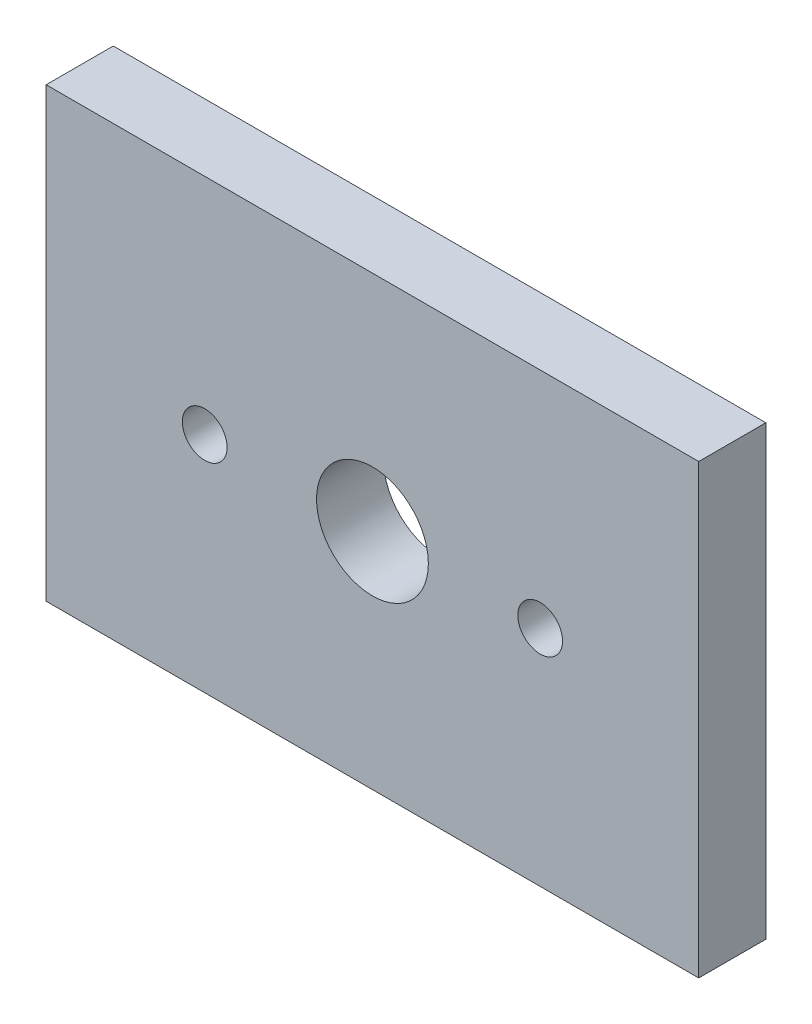
ISO-10303-21;
HEADER;
FILE_DESCRIPTION(('STEP AP214'),'2;1');
FILE_NAME('part.step','',(''),(''),'','','');
FILE_SCHEMA(('AUTOMOTIVE_DESIGN { 1 0 10303 214 1 1 1 1 }'));
ENDSEC;
DATA;
#1=APPLICATION_CONTEXT('core data for automotive mechanical design processes');
#2=APPLICATION_PROTOCOL_DEFINITION('international standard','automotive_design',2000,#1);
#3=PRODUCT_CONTEXT('',#1,'mechanical');
#4=PRODUCT('Part','Part','',(#3));
#5=PRODUCT_RELATED_PRODUCT_CATEGORY('part','',(#4));
#6=PRODUCT_DEFINITION_FORMATION('','',#4);
#7=PRODUCT_DEFINITION_CONTEXT('part definition',#1,'design');
#8=PRODUCT_DEFINITION('design','',#6,#7);
#9=PRODUCT_DEFINITION_SHAPE('','',#8);
#10=(LENGTH_UNIT() NAMED_UNIT(*) SI_UNIT(.MILLI.,.METRE.));
#11=(NAMED_UNIT(*) PLANE_ANGLE_UNIT() SI_UNIT($,.RADIAN.));
#12=(NAMED_UNIT(*) SI_UNIT($,.STERADIAN.) SOLID_ANGLE_UNIT());
#13=UNCERTAINTY_MEASURE_WITH_UNIT(LENGTH_MEASURE(1.E-05),#10,'distance_accuracy_value','');
#14=(GEOMETRIC_REPRESENTATION_CONTEXT(3) GLOBAL_UNCERTAINTY_ASSIGNED_CONTEXT((#13)) GLOBAL_UNIT_ASSIGNED_CONTEXT((#10,
#11,#12)) REPRESENTATION_CONTEXT('',''));
#15=CARTESIAN_POINT('',(0.,0.,0.));
#16=DIRECTION('',(0.,0.,1.));
#17=DIRECTION('',(1.,0.,0.));
#18=AXIS2_PLACEMENT_3D('',#15,#16,#17);
#19=CARTESIAN_POINT('',(-6.09568614177647,13.6410788381743,3.));
#20=DIRECTION('',(1.,0.,0.));
#21=DIRECTION('',(0.,1.,0.));
#22=AXIS2_PLACEMENT_3D('',#19,#20,#21);
#23=PLANE('',#22);
#24=DIRECTION('',(0.,-1.,0.));
#25=VECTOR('',#24,1.);
#26=CARTESIAN_POINT('',(-6.09568614177647,13.6410788381743,0.));
#27=LINE('',#26,#25);
#28=CARTESIAN_POINT('',(-6.09568614177647,13.6410788381743,0.));
#29=VERTEX_POINT('',#28);
#30=CARTESIAN_POINT('',(-6.09568614177647,-6.35892116182574,0.));
#31=VERTEX_POINT('',#30);
#32=EDGE_CURVE('E100',#29,#31,#27,.T.);
#33=ORIENTED_EDGE('',*,*,#32,.T.);
#34=DIRECTION('',(0.,0.,-1.));
#35=VECTOR('',#34,1.);
#36=CARTESIAN_POINT('',(-6.09568614177647,-6.35892116182574,3.));
#37=LINE('',#36,#35);
#38=CARTESIAN_POINT('',(-6.09568614177647,-6.35892116182574,3.));
#39=VERTEX_POINT('',#38);
#40=EDGE_CURVE('E11',#39,#31,#37,.T.);
#41=ORIENTED_EDGE('',*,*,#40,.F.);
#42=DIRECTION('',(0.,-1.,0.));
#43=VECTOR('',#42,1.);
#44=CARTESIAN_POINT('',(-6.09568614177647,13.6410788381743,3.));
#45=LINE('',#44,#43);
#46=CARTESIAN_POINT('',(-6.09568614177647,13.6410788381743,3.));
#47=VERTEX_POINT('',#46);
#48=EDGE_CURVE('E87',#47,#39,#45,.T.);
#49=ORIENTED_EDGE('',*,*,#48,.F.);
#50=DIRECTION('',(0.,0.,-1.));
#51=VECTOR('',#50,1.);
#52=CARTESIAN_POINT('',(-6.09568614177647,13.6410788381743,3.));
#53=LINE('',#52,#51);
#54=EDGE_CURVE('E96',#47,#29,#53,.T.);
#55=ORIENTED_EDGE('',*,*,#54,.T.);
#56=EDGE_LOOP('',(#33,#41,#49,#55));
#57=FACE_BOUND('',#56,.T.);
#58=ADVANCED_FACE('F34',(#57),#23,.F.);
#59=CARTESIAN_POINT('',(-6.09568614177647,-6.35892116182574,3.));
#60=DIRECTION('',(0.,1.,0.));
#61=DIRECTION('',(0.,0.,1.));
#62=AXIS2_PLACEMENT_3D('',#59,#60,#61);
#63=PLANE('',#62);
#64=DIRECTION('',(1.,0.,0.));
#65=VECTOR('',#64,1.);
#66=CARTESIAN_POINT('',(-6.09568614177647,-6.35892116182574,0.));
#67=LINE('',#66,#65);
#68=CARTESIAN_POINT('',(23.0819980150194,-6.35892116182574,0.));
#69=VERTEX_POINT('',#68);
#70=EDGE_CURVE('E91',#31,#69,#67,.T.);
#71=ORIENTED_EDGE('',*,*,#70,.T.);
#72=DIRECTION('',(0.,0.,-1.));
#73=VECTOR('',#72,1.);
#74=CARTESIAN_POINT('',(23.0819980150194,-6.35892116182574,3.));
#75=LINE('',#74,#73);
#76=CARTESIAN_POINT('',(23.0819980150194,-6.35892116182574,3.));
#77=VERTEX_POINT('',#76);
#78=EDGE_CURVE('E43',#77,#69,#75,.T.);
#79=ORIENTED_EDGE('',*,*,#78,.F.);
#80=DIRECTION('',(1.,0.,0.));
#81=VECTOR('',#80,1.);
#82=CARTESIAN_POINT('',(-6.09568614177647,-6.35892116182574,3.));
#83=LINE('',#82,#81);
#84=EDGE_CURVE('E82',#39,#77,#83,.T.);
#85=ORIENTED_EDGE('',*,*,#84,.F.);
#86=ORIENTED_EDGE('',*,*,#40,.T.);
#87=EDGE_LOOP('',(#71,#79,#85,#86));
#88=FACE_BOUND('',#87,.T.);
#89=ADVANCED_FACE('F90',(#88),#63,.F.);
#90=CARTESIAN_POINT('',(23.0819980150194,13.6410788381743,3.));
#91=DIRECTION('',(-1.,0.,0.));
#92=DIRECTION('',(0.,-1.,0.));
#93=AXIS2_PLACEMENT_3D('',#90,#91,#92);
#94=PLANE('',#93);
#95=DIRECTION('',(0.,1.,0.));
#96=VECTOR('',#95,1.);
#97=CARTESIAN_POINT('',(23.0819980150194,13.6410788381743,0.));
#98=LINE('',#97,#96);
#99=CARTESIAN_POINT('',(23.0819980150194,13.6410788381743,0.));
#100=VERTEX_POINT('',#99);
#101=EDGE_CURVE('E69',#69,#100,#98,.T.);
#102=ORIENTED_EDGE('',*,*,#101,.T.);
#103=DIRECTION('',(0.,0.,-1.));
#104=VECTOR('',#103,1.);
#105=CARTESIAN_POINT('',(23.0819980150194,13.6410788381743,3.));
#106=LINE('',#105,#104);
#107=CARTESIAN_POINT('',(23.0819980150194,13.6410788381743,3.));
#108=VERTEX_POINT('',#107);
#109=EDGE_CURVE('E92',#108,#100,#106,.T.);
#110=ORIENTED_EDGE('',*,*,#109,.F.);
#111=DIRECTION('',(0.,1.,0.));
#112=VECTOR('',#111,1.);
#113=CARTESIAN_POINT('',(23.0819980150194,13.6410788381743,3.));
#114=LINE('',#113,#112);
#115=EDGE_CURVE('E85',#77,#108,#114,.T.);
#116=ORIENTED_EDGE('',*,*,#115,.F.);
#117=ORIENTED_EDGE('',*,*,#78,.T.);
#118=EDGE_LOOP('',(#102,#110,#116,#117));
#119=FACE_BOUND('',#118,.T.);
#120=ADVANCED_FACE('F94',(#119),#94,.F.);
#121=CARTESIAN_POINT('',(-6.09568614177647,13.6410788381743,3.));
#122=DIRECTION('',(0.,-1.,0.));
#123=DIRECTION('',(0.,0.,-1.));
#124=AXIS2_PLACEMENT_3D('',#121,#122,#123);
#125=PLANE('',#124);
#126=DIRECTION('',(-1.,0.,0.));
#127=VECTOR('',#126,1.);
#128=CARTESIAN_POINT('',(-6.09568614177647,13.6410788381743,0.));
#129=LINE('',#128,#127);
#130=EDGE_CURVE('E75',#100,#29,#129,.T.);
#131=ORIENTED_EDGE('',*,*,#130,.T.);
#132=ORIENTED_EDGE('',*,*,#54,.F.);
#133=DIRECTION('',(-1.,0.,0.));
#134=VECTOR('',#133,1.);
#135=CARTESIAN_POINT('',(-6.09568614177647,13.6410788381743,3.));
#136=LINE('',#135,#134);
#137=EDGE_CURVE('E52',#108,#47,#136,.T.);
#138=ORIENTED_EDGE('',*,*,#137,.F.);
#139=ORIENTED_EDGE('',*,*,#109,.T.);
#140=EDGE_LOOP('',(#131,#132,#138,#139));
#141=FACE_BOUND('',#140,.T.);
#142=ADVANCED_FACE('F163',(#141),#125,.F.);
#143=CARTESIAN_POINT('',(0.,0.,3.));
#144=DIRECTION('',(0.,0.,1.));
#145=DIRECTION('',(1.,0.,0.));
#146=AXIS2_PLACEMENT_3D('',#143,#144,#145);
#147=PLANE('',#146);
#148=CARTESIAN_POINT('',(0.993155936621479,3.64107883817427,3.));
#149=DIRECTION('',(0.,0.,1.));
#150=DIRECTION('',(1.,0.,0.));
#151=AXIS2_PLACEMENT_3D('',#148,#149,#150);
#152=CIRCLE('',#151,1.);
#153=CARTESIAN_POINT('',(1.99315593662148,3.64107883817427,3.));
#154=VERTEX_POINT('',#153);
#155=EDGE_CURVE('E111',#154,#154,#152,.F.);
#156=ORIENTED_EDGE('',*,*,#155,.T.);
#157=EDGE_LOOP('',(#156));
#158=FACE_BOUND('',#157,.T.);
#159=CARTESIAN_POINT('',(15.9931559366215,3.64107883817427,3.));
#160=DIRECTION('',(0.,0.,1.));
#161=DIRECTION('',(1.,0.,0.));
#162=AXIS2_PLACEMENT_3D('',#159,#160,#161);
#163=CIRCLE('',#162,1.);
#164=CARTESIAN_POINT('',(16.9931559366215,3.64107883817427,3.));
#165=VERTEX_POINT('',#164);
#166=EDGE_CURVE('E114',#165,#165,#163,.F.);
#167=ORIENTED_EDGE('',*,*,#166,.T.);
#168=EDGE_LOOP('',(#167));
#169=FACE_BOUND('',#168,.T.);
#170=CARTESIAN_POINT('',(8.49315593662148,3.64107883817426,3.));
#171=DIRECTION('',(0.,0.,1.));
#172=DIRECTION('',(1.,0.,0.));
#173=AXIS2_PLACEMENT_3D('',#170,#171,#172);
#174=CIRCLE('',#173,2.5);
#175=CARTESIAN_POINT('',(10.9931559366215,3.64107883817426,3.));
#176=VERTEX_POINT('',#175);
#177=EDGE_CURVE('E124',#176,#176,#174,.F.);
#178=ORIENTED_EDGE('',*,*,#177,.T.);
#179=EDGE_LOOP('',(#178));
#180=FACE_BOUND('',#179,.T.);
#181=ORIENTED_EDGE('',*,*,#48,.T.);
#182=ORIENTED_EDGE('',*,*,#84,.T.);
#183=ORIENTED_EDGE('',*,*,#115,.T.);
#184=ORIENTED_EDGE('',*,*,#137,.T.);
#185=EDGE_LOOP('',(#181,#182,#183,#184));
#186=FACE_BOUND('',#185,.T.);
#187=ADVANCED_FACE('F83',(#158,#169,#180,#186),#147,.T.);
#188=CARTESIAN_POINT('',(0.,0.,0.));
#189=DIRECTION('',(0.,0.,1.));
#190=DIRECTION('',(1.,0.,0.));
#191=AXIS2_PLACEMENT_3D('',#188,#189,#190);
#192=PLANE('',#191);
#193=CARTESIAN_POINT('',(8.49315593662148,3.64107883817426,0.));
#194=DIRECTION('',(0.,0.,1.));
#195=DIRECTION('',(1.,0.,0.));
#196=AXIS2_PLACEMENT_3D('',#193,#194,#195);
#197=CIRCLE('',#196,2.5);
#198=CARTESIAN_POINT('',(10.9931559366215,3.64107883817426,0.));
#199=VERTEX_POINT('',#198);
#200=EDGE_CURVE('E37',#199,#199,#197,.F.);
#201=ORIENTED_EDGE('',*,*,#200,.F.);
#202=EDGE_LOOP('',(#201));
#203=FACE_BOUND('',#202,.T.);
#204=CARTESIAN_POINT('',(0.993155936621465,3.64107883817427,0.));
#205=DIRECTION('',(0.,0.,1.));
#206=DIRECTION('',(-1.,0.,0.));
#207=AXIS2_PLACEMENT_3D('',#204,#205,#206);
#208=CIRCLE('',#207,2.);
#209=CARTESIAN_POINT('',(-1.00684406337853,3.64107883817427,0.));
#210=VERTEX_POINT('',#209);
#211=EDGE_CURVE('E127',#210,#210,#208,.T.);
#212=ORIENTED_EDGE('',*,*,#211,.T.);
#213=EDGE_LOOP('',(#212));
#214=FACE_BOUND('',#213,.T.);
#215=CARTESIAN_POINT('',(15.9931559366215,3.64107883817427,0.));
#216=DIRECTION('',(0.,0.,1.));
#217=DIRECTION('',(1.,0.,0.));
#218=AXIS2_PLACEMENT_3D('',#215,#216,#217);
#219=CIRCLE('',#218,2.);
#220=CARTESIAN_POINT('',(17.9931559366215,3.64107883817427,0.));
#221=VERTEX_POINT('',#220);
#222=EDGE_CURVE('E131',#221,#221,#219,.T.);
#223=ORIENTED_EDGE('',*,*,#222,.T.);
#224=EDGE_LOOP('',(#223));
#225=FACE_BOUND('',#224,.T.);
#226=ORIENTED_EDGE('',*,*,#32,.F.);
#227=ORIENTED_EDGE('',*,*,#130,.F.);
#228=ORIENTED_EDGE('',*,*,#101,.F.);
#229=ORIENTED_EDGE('',*,*,#70,.F.);
#230=EDGE_LOOP('',(#226,#227,#228,#229));
#231=FACE_BOUND('',#230,.T.);
#232=ADVANCED_FACE('F139',(#203,#214,#225,#231),#192,.F.);
#233=CARTESIAN_POINT('',(15.9931559366215,3.64107883817427,-3.));
#234=DIRECTION('',(0.,0.,1.));
#235=DIRECTION('',(1.,0.,0.));
#236=AXIS2_PLACEMENT_3D('',#233,#234,#235);
#237=CYLINDRICAL_SURFACE('',#236,2.);
#238=CARTESIAN_POINT('',(15.9931559366215,3.64107883817427,-3.));
#239=DIRECTION('',(0.,0.,1.));
#240=DIRECTION('',(1.,0.,0.));
#241=AXIS2_PLACEMENT_3D('',#238,#239,#240);
#242=CIRCLE('',#241,2.);
#243=CARTESIAN_POINT('',(17.9931559366215,3.64107883817427,-3.));
#244=VERTEX_POINT('',#243);
#245=EDGE_CURVE('E103',#244,#244,#242,.T.);
#246=ORIENTED_EDGE('',*,*,#245,.T.);
#247=EDGE_LOOP('',(#246));
#248=FACE_BOUND('',#247,.T.);
#249=ORIENTED_EDGE('',*,*,#222,.F.);
#250=EDGE_LOOP('',(#249));
#251=FACE_BOUND('',#250,.T.);
#252=ADVANCED_FACE('F142',(#248,#251),#237,.T.);
#253=CARTESIAN_POINT('',(15.9931559366215,3.64107883817427,-3.));
#254=DIRECTION('',(0.,0.,1.));
#255=DIRECTION('',(1.,0.,0.));
#256=AXIS2_PLACEMENT_3D('',#253,#254,#255);
#257=PLANE('',#256);
#258=CARTESIAN_POINT('',(15.9931559366215,3.64107883817427,-3.));
#259=DIRECTION('',(0.,0.,1.));
#260=DIRECTION('',(1.,0.,0.));
#261=AXIS2_PLACEMENT_3D('',#258,#259,#260);
#262=CIRCLE('',#261,1.);
#263=CARTESIAN_POINT('',(16.9931559366215,3.64107883817427,-3.));
#264=VERTEX_POINT('',#263);
#265=EDGE_CURVE('E112',#264,#264,#262,.F.);
#266=ORIENTED_EDGE('',*,*,#265,.F.);
#267=EDGE_LOOP('',(#266));
#268=FACE_BOUND('',#267,.T.);
#269=ORIENTED_EDGE('',*,*,#245,.F.);
#270=EDGE_LOOP('',(#269));
#271=FACE_BOUND('',#270,.T.);
#272=ADVANCED_FACE('F144',(#268,#271),#257,.F.);
#273=CARTESIAN_POINT('',(0.993155936621465,3.64107883817427,-3.));
#274=DIRECTION('',(0.,0.,1.));
#275=DIRECTION('',(1.,0.,0.));
#276=AXIS2_PLACEMENT_3D('',#273,#274,#275);
#277=CYLINDRICAL_SURFACE('',#276,2.);
#278=CARTESIAN_POINT('',(0.993155936621465,3.64107883817427,-3.));
#279=DIRECTION('',(0.,0.,1.));
#280=DIRECTION('',(-1.,0.,0.));
#281=AXIS2_PLACEMENT_3D('',#278,#279,#280);
#282=CIRCLE('',#281,2.);
#283=CARTESIAN_POINT('',(-1.00684406337853,3.64107883817427,-3.));
#284=VERTEX_POINT('',#283);
#285=EDGE_CURVE('E128',#284,#284,#282,.T.);
#286=ORIENTED_EDGE('',*,*,#285,.T.);
#287=EDGE_LOOP('',(#286));
#288=FACE_BOUND('',#287,.T.);
#289=ORIENTED_EDGE('',*,*,#211,.F.);
#290=EDGE_LOOP('',(#289));
#291=FACE_BOUND('',#290,.T.);
#292=ADVANCED_FACE('F151',(#288,#291),#277,.T.);
#293=CARTESIAN_POINT('',(0.993155936621465,3.64107883817427,-3.));
#294=DIRECTION('',(0.,0.,-1.));
#295=DIRECTION('',(-1.,0.,0.));
#296=AXIS2_PLACEMENT_3D('',#293,#294,#295);
#297=PLANE('',#296);
#298=CARTESIAN_POINT('',(0.993155936621479,3.64107883817427,-3.));
#299=DIRECTION('',(0.,0.,-1.));
#300=DIRECTION('',(-1.,0.,0.));
#301=AXIS2_PLACEMENT_3D('',#298,#299,#300);
#302=CIRCLE('',#301,1.);
#303=CARTESIAN_POINT('',(-0.00684406337852117,3.64107883817427,-3.));
#304=VERTEX_POINT('',#303);
#305=EDGE_CURVE('E109',#304,#304,#302,.F.);
#306=ORIENTED_EDGE('',*,*,#305,.T.);
#307=EDGE_LOOP('',(#306));
#308=FACE_BOUND('',#307,.T.);
#309=ORIENTED_EDGE('',*,*,#285,.F.);
#310=EDGE_LOOP('',(#309));
#311=FACE_BOUND('',#310,.T.);
#312=ADVANCED_FACE('F217',(#308,#311),#297,.T.);
#313=CARTESIAN_POINT('',(0.993155936621479,3.64107883817427,10.));
#314=DIRECTION('',(0.,0.,-1.));
#315=DIRECTION('',(-1.,0.,0.));
#316=AXIS2_PLACEMENT_3D('',#313,#314,#315);
#317=CYLINDRICAL_SURFACE('',#316,1.);
#318=ORIENTED_EDGE('',*,*,#155,.F.);
#319=EDGE_LOOP('',(#318));
#320=FACE_BOUND('',#319,.T.);
#321=ORIENTED_EDGE('',*,*,#305,.F.);
#322=EDGE_LOOP('',(#321));
#323=FACE_BOUND('',#322,.T.);
#324=ADVANCED_FACE('F225',(#320,#323),#317,.F.);
#325=CARTESIAN_POINT('',(15.9931559366215,3.64107883817427,10.));
#326=DIRECTION('',(0.,0.,-1.));
#327=DIRECTION('',(-1.,0.,0.));
#328=AXIS2_PLACEMENT_3D('',#325,#326,#327);
#329=CYLINDRICAL_SURFACE('',#328,1.);
#330=ORIENTED_EDGE('',*,*,#166,.F.);
#331=EDGE_LOOP('',(#330));
#332=FACE_BOUND('',#331,.T.);
#333=ORIENTED_EDGE('',*,*,#265,.T.);
#334=EDGE_LOOP('',(#333));
#335=FACE_BOUND('',#334,.T.);
#336=ADVANCED_FACE('F234',(#332,#335),#329,.F.);
#337=CARTESIAN_POINT('',(8.49315593662148,3.64107883817426,10.));
#338=DIRECTION('',(0.,0.,-1.));
#339=DIRECTION('',(-1.,0.,0.));
#340=AXIS2_PLACEMENT_3D('',#337,#338,#339);
#341=CYLINDRICAL_SURFACE('',#340,2.5);
#342=ORIENTED_EDGE('',*,*,#177,.F.);
#343=EDGE_LOOP('',(#342));
#344=FACE_BOUND('',#343,.T.);
#345=ORIENTED_EDGE('',*,*,#200,.T.);
#346=EDGE_LOOP('',(#345));
#347=FACE_BOUND('',#346,.T.);
#348=ADVANCED_FACE('F243',(#344,#347),#341,.F.);
#349=CLOSED_SHELL('',(#58,#89,#120,#142,#187,#232,#252,#272,#292,#312,#324,#336,#348));
#350=MANIFOLD_SOLID_BREP('B2',#349);
#351=ADVANCED_BREP_SHAPE_REPRESENTATION('',(#18,#350),#14);
#352=SHAPE_DEFINITION_REPRESENTATION(#9,#351);
ENDSEC;
END-ISO-10303-21;
